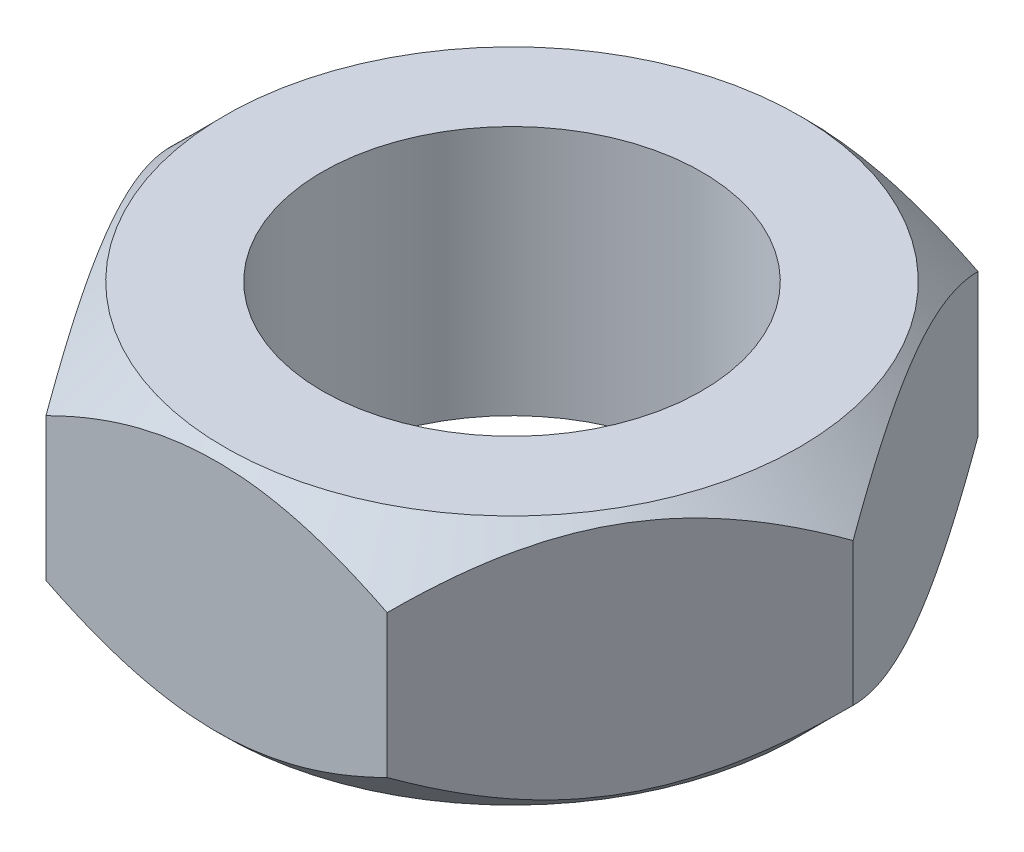
ISO-10303-21;
HEADER;
FILE_DESCRIPTION(('STEP AP214'),'2;1');
FILE_NAME('part.step','',(''),(''),'','','');
FILE_SCHEMA(('AUTOMOTIVE_DESIGN { 1 0 10303 214 1 1 1 1 }'));
ENDSEC;
DATA;
#1=APPLICATION_CONTEXT('core data for automotive mechanical design processes');
#2=APPLICATION_PROTOCOL_DEFINITION('international standard','automotive_design',2000,#1);
#3=PRODUCT_CONTEXT('',#1,'mechanical');
#4=PRODUCT('Part','Part','',(#3));
#5=PRODUCT_RELATED_PRODUCT_CATEGORY('part','',(#4));
#6=PRODUCT_DEFINITION_FORMATION('','',#4);
#7=PRODUCT_DEFINITION_CONTEXT('part definition',#1,'design');
#8=PRODUCT_DEFINITION('design','',#6,#7);
#9=PRODUCT_DEFINITION_SHAPE('','',#8);
#10=(LENGTH_UNIT() NAMED_UNIT(*) SI_UNIT(.MILLI.,.METRE.));
#11=(NAMED_UNIT(*) PLANE_ANGLE_UNIT() SI_UNIT($,.RADIAN.));
#12=(NAMED_UNIT(*) SI_UNIT($,.STERADIAN.) SOLID_ANGLE_UNIT());
#13=UNCERTAINTY_MEASURE_WITH_UNIT(LENGTH_MEASURE(1.E-05),#10,'distance_accuracy_value','');
#14=(GEOMETRIC_REPRESENTATION_CONTEXT(3) GLOBAL_UNCERTAINTY_ASSIGNED_CONTEXT((#13)) GLOBAL_UNIT_ASSIGNED_CONTEXT((#10,
#11,#12)) REPRESENTATION_CONTEXT('',''));
#15=CARTESIAN_POINT('',(0.,0.,0.));
#16=DIRECTION('',(0.,0.,1.));
#17=DIRECTION('',(1.,0.,0.));
#18=AXIS2_PLACEMENT_3D('',#15,#16,#17);
#19=CARTESIAN_POINT('',(-3.14655896708346,-1.155,0.));
#20=DIRECTION('',(-0.866025403784439,0.,0.5));
#21=DIRECTION('',(0.5,0.,0.866025403784439));
#22=AXIS2_PLACEMENT_3D('',#19,#20,#21);
#23=PLANE('',#22);
#24=DIRECTION('',(0.,1.,0.));
#25=VECTOR('',#24,1.);
#26=CARTESIAN_POINT('',(-3.14655896708346,-1.155,0.));
#27=LINE('',#26,#25);
#28=CARTESIAN_POINT('',(-3.14655896705142,-0.658441033018876,-9.91987847607198E-12));
#29=VERTEX_POINT('',#28);
#30=CARTESIAN_POINT('',(-3.14655896705142,0.658441032981914,9.9205367773086E-12));
#31=VERTEX_POINT('',#30);
#32=EDGE_CURVE('E39',#29,#31,#27,.T.);
#33=ORIENTED_EDGE('',*,*,#32,.F.);
#34=CARTESIAN_POINT('',(-1.57327947661864,-0.65844102605013,2.72500001199114));
#35=CARTESIAN_POINT('',(-1.62735386123348,-0.712463516904452,2.63134043045022));
#36=CARTESIAN_POINT('',(-1.6823323706731,-0.763312652071408,2.53611485877639));
#37=CARTESIAN_POINT('',(-1.79443919346344,-0.856415247858666,2.34194014582841));
#38=CARTESIAN_POINT('',(-1.85157816235362,-0.898616923151454,2.24297254861852));
#39=CARTESIAN_POINT('',(-1.96679609041732,-0.970908676922338,2.04340924326938));
#40=CARTESIAN_POINT('',(-2.02484572287343,-1.00118040895592,1.9428643304947));
#41=CARTESIAN_POINT('',(-2.14222259544126,-1.04781977786927,1.73956162357367));
#42=CARTESIAN_POINT('',(-2.20154625243596,-1.06422221622433,1.63681003556805));
#43=CARTESIAN_POINT('',(-2.30379330787486,-1.07902183783569,1.45971294062358));
#44=CARTESIAN_POINT('',(-2.34658470507545,-1.08121199921989,1.3855960665453));
#45=CARTESIAN_POINT('',(-2.43209748584829,-1.07751747483381,1.23748358555024));
#46=CARTESIAN_POINT('',(-2.47481883962627,-1.07162995875759,1.16348803023865));
#47=CARTESIAN_POINT('',(-2.559858086055,-1.05211512241492,1.01619573478671));
#48=CARTESIAN_POINT('',(-2.60217547373816,-1.03847914867073,0.942899869275893));
#49=CARTESIAN_POINT('',(-2.68607845449582,-1.00421588211183,0.797575643697147));
#50=CARTESIAN_POINT('',(-2.72766410343584,-0.983589125474777,0.72554718686731));
#51=CARTESIAN_POINT('',(-2.83415795547277,-0.922368945219737,0.541094424445632));
#52=CARTESIAN_POINT('',(-2.89840651297627,-0.877165914139737,0.429812658536556));
#53=CARTESIAN_POINT('',(-2.99287907813309,-0.800859203653019,0.266181375763585));
#54=CARTESIAN_POINT('',(-3.02401210646256,-0.774048879221555,0.212257388903462));
#55=CARTESIAN_POINT('',(-3.08570170402884,-0.717984625210718,0.105407871620191));
#56=CARTESIAN_POINT('',(-3.11625861267117,-0.688732193218045,0.0524817533294258));
#57=CARTESIAN_POINT('',(-3.14655896709454,-0.658441032962138,-1.91937883932893E-11));
#58=B_SPLINE_CURVE_WITH_KNOTS('',3,(#34,#35,#36,#37,#38,#39,#40,#41,#42,#43,#44,#45,#46,#47,#48,
#49,#50,#51,#52,#53,#54,#55,#56,#57),.UNSPECIFIED.,.F.,.F.,(4,2,2,2,2,2,2,2,2,2,2,4),(0.,
0.362923532673089,0.727960707050709,1.0872023253452,1.44553982005292,1.70200875168351,
1.95856756941672,2.21541347676497,2.47223968905425,2.88003270467439,3.08337607099432,
3.28659564327083),.UNSPECIFIED.);
#59=CARTESIAN_POINT('',(-1.57327944834864,-0.658441050569766,2.725));
#60=VERTEX_POINT('',#59);
#61=EDGE_CURVE('E68',#60,#29,#58,.T.);
#62=ORIENTED_EDGE('',*,*,#61,.F.);
#63=DIRECTION('',(0.,1.,0.));
#64=VECTOR('',#63,1.);
#65=CARTESIAN_POINT('',(-1.57327948354173,-1.155,2.725));
#66=LINE('',#65,#64);
#67=CARTESIAN_POINT('',(-1.57327950113764,0.65844105056913,2.72499996952299));
#68=VERTEX_POINT('',#67);
#69=EDGE_CURVE('E95',#68,#60,#66,.F.);
#70=ORIENTED_EDGE('',*,*,#69,.F.);
#71=CARTESIAN_POINT('',(-3.14655896708598,0.658441032957749,-2.26789969055328E-11));
#72=CARTESIAN_POINT('',(-3.09248458291758,0.712463523021247,0.0936595807567098));
#73=CARTESIAN_POINT('',(-3.03750607393318,0.763312657411236,0.188885151646903));
#74=CARTESIAN_POINT('',(-2.92539925209313,0.856415251722121,0.383059862952489));
#75=CARTESIAN_POINT('',(-2.86826028369845,0.898616926317329,0.48202745930283));
#76=CARTESIAN_POINT('',(-2.75304235658878,0.970908678902312,0.681590762998606));
#77=CARTESIAN_POINT('',(-2.69499272458834,1.00118041043142,0.782135674984402));
#78=CARTESIAN_POINT('',(-2.57761585296116,1.04781977853535,0.985438380276408));
#79=CARTESIAN_POINT('',(-2.51829219645127,1.0642222165841,1.0881899674422));
#80=CARTESIAN_POINT('',(-2.41604514151374,1.07902183793696,1.26528706151824));
#81=CARTESIAN_POINT('',(-2.37325374432372,1.08121199924301,1.33940393557823));
#82=CARTESIAN_POINT('',(-2.28774096357569,1.07751747470588,1.48751641653034));
#83=CARTESIAN_POINT('',(-2.24501960981194,1.07162995855678,1.56151197181726));
#84=CARTESIAN_POINT('',(-2.15998036343472,1.05211512208262,1.70880426717998));
#85=CARTESIAN_POINT('',(-2.11766297578862,1.03847914828348,1.78210013262661));
#86=CARTESIAN_POINT('',(-2.03375999510579,1.00421588163247,1.92742435807575));
#87=CARTESIAN_POINT('',(-1.99217434620352,0.983589124958324,1.99945281484019));
#88=CARTESIAN_POINT('',(-1.8856805006944,0.922368948325799,2.18390556595539));
#89=CARTESIAN_POINT('',(-1.82143194946698,0.877165922422192,2.29518732099396));
#90=CARTESIAN_POINT('',(-1.72695939334917,0.800859221130555,2.45881858811091));
#91=CARTESIAN_POINT('',(-1.69582636796464,0.774048899995241,2.51274256987025));
#92=CARTESIAN_POINT('',(-1.6341367761759,0.717984652945768,2.61959207714653));
#93=CARTESIAN_POINT('',(-1.60357987036637,0.68873222461744,2.67251819053073));
#94=CARTESIAN_POINT('',(-1.57327951873355,0.658441068165039,2.72499993904598));
#95=B_SPLINE_CURVE_WITH_KNOTS('',3,(#71,#72,#73,#74,#75,#76,#77,#78,#79,#80,#81,#82,#83,#84,#85,
#86,#87,#88,#89,#90,#91,#92,#93,#94),.UNSPECIFIED.,.F.,.F.,(4,2,2,2,2,2,2,2,2,2,2,4),(0.,
0.362923529235543,0.727960700102343,1.08720231538261,1.44553980710645,1.70200873866747,
1.95856755633097,2.2154134634879,2.47223967558245,2.88003265077597,3.08337599696134,
3.28659554916829),.UNSPECIFIED.);
#96=EDGE_CURVE('E69',#31,#68,#95,.T.);
#97=ORIENTED_EDGE('',*,*,#96,.F.);
#98=EDGE_LOOP('',(#33,#62,#70,#97));
#99=FACE_BOUND('',#98,.T.);
#100=ADVANCED_FACE('F15',(#99),#23,.T.);
#101=CARTESIAN_POINT('',(-1.57327948354173,-1.155,2.725));
#102=DIRECTION('',(0.,0.,1.));
#103=DIRECTION('',(1.,0.,0.));
#104=AXIS2_PLACEMENT_3D('',#101,#102,#103);
#105=PLANE('',#104);
#106=ORIENTED_EDGE('',*,*,#69,.T.);
#107=CARTESIAN_POINT('',(1.57327949738658,-0.658441026050797,2.725));
#108=CARTESIAN_POINT('',(1.46513072821672,-0.712463516875228,2.725));
#109=CARTESIAN_POINT('',(1.35517370939962,-0.763312652015631,2.725));
#110=CARTESIAN_POINT('',(1.13096006394724,-0.856415247761064,2.725));
#111=CARTESIAN_POINT('',(1.01668212623304,-0.898616923038605,2.725));
#112=CARTESIAN_POINT('',(0.786246270113395,-0.970908676834788,2.725));
#113=CARTESIAN_POINT('',(0.670147005138711,-1.00118040889625,2.725));
#114=CARTESIAN_POINT('',(0.435393259874703,-1.04781977785093,2.725));
#115=CARTESIAN_POINT('',(0.316745945819439,-1.06422221621953,2.725));
#116=CARTESIAN_POINT('',(0.112251834851884,-1.07902183783741,2.725));
#117=CARTESIAN_POINT('',(0.0266690404272164,-1.0812119992211,2.725));
#118=CARTESIAN_POINT('',(-0.144356521165615,-1.07751747482955,2.725));
#119=CARTESIAN_POINT('',(-0.229799228745238,-1.07162995874835,2.725));
#120=CARTESIAN_POINT('',(-0.399877721602359,-1.05211512239714,2.725));
#121=CARTESIAN_POINT('',(-0.484512496945161,-1.03847914865362,2.725));
#122=CARTESIAN_POINT('',(-0.652318458414021,-1.00421588210003,2.725));
#123=CARTESIAN_POINT('',(-0.73548975627113,-0.983589125467719,2.725));
#124=CARTESIAN_POINT('',(-0.948477447671822,-0.922368948855335,2.725));
#125=CARTESIAN_POINT('',(-1.07697455044826,-0.877165922891068,2.725));
#126=CARTESIAN_POINT('',(-1.26591966315461,-0.800859221458968,2.725));
#127=CARTESIAN_POINT('',(-1.32818571408183,-0.774048900266952,2.725));
#128=CARTESIAN_POINT('',(-1.4515648979694,-0.717984653091195,2.725));
#129=CARTESIAN_POINT('',(-1.51267870974041,-0.688732224693312,2.725));
#130=CARTESIAN_POINT('',(-1.57327941315554,-0.658441068166313,2.725));
#131=B_SPLINE_CURVE_WITH_KNOTS('',3,(#107,#108,#109,#110,#111,#112,#113,#114,#115,#116,#117,
#118,#119,#120,#121,#122,#123,#124,#125,#126,#127,#128,#129,#130),.UNSPECIFIED.,.F.,.F.,(4,2,2,
2,2,2,2,2,2,2,2,4),(0.,0.362923532471594,0.727960706648163,1.08720232514412,1.44553982005144,
1.70200875175219,1.95856756955672,2.21541347683605,2.4722396890527,2.8800326652089,
3.08337601189709,3.28659556460498),.UNSPECIFIED.);
#132=CARTESIAN_POINT('',(1.57327950113794,-0.658441050569433,2.72499996952246));
#133=VERTEX_POINT('',#132);
#134=EDGE_CURVE('E81',#133,#60,#131,.T.);
#135=ORIENTED_EDGE('',*,*,#134,.F.);
#136=DIRECTION('',(0.,1.,0.));
#137=VECTOR('',#136,1.);
#138=CARTESIAN_POINT('',(1.57327948354173,-1.155,2.725));
#139=LINE('',#138,#137);
#140=CARTESIAN_POINT('',(1.57327944835712,0.658441050565525,2.725));
#141=VERTEX_POINT('',#140);
#142=EDGE_CURVE('E93',#141,#133,#139,.F.);
#143=ORIENTED_EDGE('',*,*,#142,.F.);
#144=CARTESIAN_POINT('',(-1.57327949738536,0.658441026051404,2.725));
#145=CARTESIAN_POINT('',(-1.46513072821556,0.712463516875775,2.725));
#146=CARTESIAN_POINT('',(-1.35517370939852,0.763312652016118,2.725));
#147=CARTESIAN_POINT('',(-1.13096006394627,0.856415247761435,2.725));
#148=CARTESIAN_POINT('',(-1.01668212623213,0.89861692303892,2.725));
#149=CARTESIAN_POINT('',(-0.786246270112653,0.970908676834991,2.725));
#150=CARTESIAN_POINT('',(-0.670147005138069,1.0011804088964,2.725));
#151=CARTESIAN_POINT('',(-0.435393259874268,1.047819777851,2.725));
#152=CARTESIAN_POINT('',(-0.316745945819111,1.06422221621956,2.725));
#153=CARTESIAN_POINT('',(-0.112251834851674,1.07902183783741,2.725));
#154=CARTESIAN_POINT('',(-0.0266690404270152,1.0812119992211,2.725));
#155=CARTESIAN_POINT('',(0.144356521165797,1.07751747482954,2.725));
#156=CARTESIAN_POINT('',(0.229799228745409,1.07162995874834,2.725));
#157=CARTESIAN_POINT('',(0.399877721602521,1.05211512239712,2.725));
#158=CARTESIAN_POINT('',(0.484512496945325,1.03847914865359,2.725));
#159=CARTESIAN_POINT('',(0.652318458414186,1.00421588209999,2.725));
#160=CARTESIAN_POINT('',(0.735489756271297,0.983589125467675,2.725));
#161=CARTESIAN_POINT('',(0.948477447675009,0.922368948854412,2.725));
#162=CARTESIAN_POINT('',(1.07697455045436,0.877165922888918,2.725));
#163=CARTESIAN_POINT('',(1.26591966316491,0.800859221454648,2.725));
#164=CARTESIAN_POINT('',(1.3281857140935,0.774048900261857,2.725));
#165=CARTESIAN_POINT('',(1.45156489798376,0.717984653084463,2.725));
#166=CARTESIAN_POINT('',(1.51267870975608,0.688732224685721,2.725));
#167=CARTESIAN_POINT('',(1.57327941317251,0.65844106815783,2.725));
#168=B_SPLINE_CURVE_WITH_KNOTS('',3,(#144,#145,#146,#147,#148,#149,#150,#151,#152,#153,#154,
#155,#156,#157,#158,#159,#160,#161,#162,#163,#164,#165,#166,#167),.UNSPECIFIED.,.F.,.F.,(4,2,2,
2,2,2,2,2,2,2,2,4),(0.,0.362923532471359,0.727960706647685,1.08720232514331,1.44553982005031,
1.70200875175102,1.95856756955553,2.21541347683486,2.47223968905152,2.88003266521715,
3.08337601191002,3.28659556462258),.UNSPECIFIED.);
#169=EDGE_CURVE('E165',#68,#141,#168,.T.);
#170=ORIENTED_EDGE('',*,*,#169,.F.);
#171=EDGE_LOOP('',(#106,#135,#143,#170));
#172=FACE_BOUND('',#171,.T.);
#173=ADVANCED_FACE('F153',(#172),#105,.T.);
#174=CARTESIAN_POINT('',(1.57327948354173,-1.155,2.725));
#175=DIRECTION('',(0.866025403784439,0.,0.5));
#176=DIRECTION('',(0.5,0.,-0.866025403784439));
#177=AXIS2_PLACEMENT_3D('',#174,#175,#176);
#178=PLANE('',#177);
#179=ORIENTED_EDGE('',*,*,#142,.T.);
#180=CARTESIAN_POINT('',(3.14655896709377,-0.658441032955759,-2.79707116706525E-11));
#181=CARTESIAN_POINT('',(3.09248458292254,-0.712463523018576,0.093659580751081));
#182=CARTESIAN_POINT('',(3.03750607393678,-0.763312657408559,0.188885151641451));
#183=CARTESIAN_POINT('',(2.92539925209531,-0.856415251719988,0.383059862947903));
#184=CARTESIAN_POINT('',(2.86826028370058,-0.898616926315747,0.482027459298937));
#185=CARTESIAN_POINT('',(2.75304235659039,-0.970908678901546,0.681590762996027));
#186=CARTESIAN_POINT('',(2.6949927245895,-1.00118041043092,0.782135674982447));
#187=CARTESIAN_POINT('',(2.5776158529615,-1.04781977853525,0.985438380275756));
#188=CARTESIAN_POINT('',(2.51829219645125,-1.06422221658414,1.08818996744222));
#189=CARTESIAN_POINT('',(2.4160451415133,-1.079021837937,1.26528706151902));
#190=CARTESIAN_POINT('',(2.37325374432323,-1.08121199924303,1.33940393557908));
#191=CARTESIAN_POINT('',(2.28774096357511,-1.07751747470583,1.48751641653133));
#192=CARTESIAN_POINT('',(2.24501960981132,-1.07162995855668,1.56151197181833));
#193=CARTESIAN_POINT('',(2.15998036343402,-1.05211512208242,1.70880426718118));
#194=CARTESIAN_POINT('',(2.1176629757879,-1.03847914828323,1.78210013262786));
#195=CARTESIAN_POINT('',(2.033759995105,-1.0042158816321,1.92742435807711));
#196=CARTESIAN_POINT('',(1.9921743462027,-0.983589124957898,1.99945281484161));
#197=CARTESIAN_POINT('',(1.88568050069381,-0.922368948325392,2.1839055659564));
#198=CARTESIAN_POINT('',(1.82143194946666,-0.877165922421934,2.29518732099452));
#199=CARTESIAN_POINT('',(1.72695939334921,-0.800859221130585,2.45881858811084));
#200=CARTESIAN_POINT('',(1.6958263679648,-0.774048899995375,2.51274256986998));
#201=CARTESIAN_POINT('',(1.63413677617628,-0.717984652946126,2.61959207714586));
#202=CARTESIAN_POINT('',(1.60357987036687,-0.688732224617919,2.67251819052987));
#203=CARTESIAN_POINT('',(1.57327951873416,-0.658441068165646,2.72499993904493));
#204=B_SPLINE_CURVE_WITH_KNOTS('',3,(#180,#181,#182,#183,#184,#185,#186,#187,#188,#189,#190,
#191,#192,#193,#194,#195,#196,#197,#198,#199,#200,#201,#202,#203),.UNSPECIFIED.,.F.,.F.,(4,2,2,
2,2,2,2,2,2,2,2,4),(0.,0.362923529237788,0.727960700106964,1.08720231538962,1.4455398071158,
1.70200873867707,1.95856755634082,2.21541346349797,2.47223967559275,2.88003265078467,
3.08337599696928,3.28659554917546),.UNSPECIFIED.);
#205=CARTESIAN_POINT('',(3.14655896706963,-0.658441032986452,0.));
#206=VERTEX_POINT('',#205);
#207=EDGE_CURVE('E142',#206,#133,#204,.T.);
#208=ORIENTED_EDGE('',*,*,#207,.F.);
#209=DIRECTION('',(0.,1.,0.));
#210=VECTOR('',#209,1.);
#211=CARTESIAN_POINT('',(3.14655896708346,-1.155,0.));
#212=LINE('',#211,#210);
#213=CARTESIAN_POINT('',(3.1465589671878,0.658441032736116,0.));
#214=VERTEX_POINT('',#213);
#215=EDGE_CURVE('E91',#214,#206,#212,.F.);
#216=ORIENTED_EDGE('',*,*,#215,.F.);
#217=CARTESIAN_POINT('',(1.57327947662712,0.658441026058613,2.72500001197645));
#218=CARTESIAN_POINT('',(1.62735386124146,0.712463516912001,2.6313404304364));
#219=CARTESIAN_POINT('',(1.68233237068057,0.763312652078038,2.53611485876345));
#220=CARTESIAN_POINT('',(1.79443919346983,0.856415247863539,2.34194014581734));
#221=CARTESIAN_POINT('',(1.85157816235944,0.898616923155491,2.24297254860843));
#222=CARTESIAN_POINT('',(1.96679609042198,0.970908676924886,2.04340924326131));
#223=CARTESIAN_POINT('',(2.02484572287748,1.00118040895782,1.94286433048767));
#224=CARTESIAN_POINT('',(2.14222259544408,1.04781977787011,1.73956162356879));
#225=CARTESIAN_POINT('',(2.20154625243814,1.06422221622478,1.63681003556428));
#226=CARTESIAN_POINT('',(2.30379330787636,1.07902183783581,1.45971294062098));
#227=CARTESIAN_POINT('',(2.34658470507692,1.08121199921992,1.38559606654274));
#228=CARTESIAN_POINT('',(2.4320974858497,1.07751747483365,1.23748358554779));
#229=CARTESIAN_POINT('',(2.47481883962765,1.07162995875736,1.16348803023626));
#230=CARTESIAN_POINT('',(2.55985808605632,1.05211512241454,1.01619573478443));
#231=CARTESIAN_POINT('',(2.60217547373945,1.03847914867028,0.942899869273661));
#232=CARTESIAN_POINT('',(2.68607845449705,1.00421588211126,0.79757564369502));
#233=CARTESIAN_POINT('',(2.72766410343704,0.98358912547415,0.725547186865236));
#234=CARTESIAN_POINT('',(2.83415795547444,0.922368945218677,0.541094424442732));
#235=CARTESIAN_POINT('',(2.89840651297843,0.877165914138177,0.42981265853281));
#236=CARTESIAN_POINT('',(2.99287907813595,0.800859203650614,0.266181375758628));
#237=CARTESIAN_POINT('',(3.02401210646565,0.774048879218855,0.212257388898115));
#238=CARTESIAN_POINT('',(3.08570170403237,0.717984625207406,0.105407871614081));
#239=CARTESIAN_POINT('',(3.11625861267492,0.688732193214415,0.0524817533229416));
#240=CARTESIAN_POINT('',(3.1465589670985,0.658441032958181,-2.60468463529722E-11));
#241=B_SPLINE_CURVE_WITH_KNOTS('',3,(#217,#218,#219,#220,#221,#222,#223,#224,#225,#226,#227,
#228,#229,#230,#231,#232,#233,#234,#235,#236,#237,#238,#239,#240),.UNSPECIFIED.,.F.,.F.,(4,2,2,
2,2,2,2,2,2,2,2,4),(0.,0.36292353266914,0.727960707042721,1.08720232533324,1.44553982003704,
1.70200875166745,1.95856756940048,2.21541347674859,2.47223968903772,2.88003270466112,
3.08337607098263,3.28659564326072),.UNSPECIFIED.);
#242=EDGE_CURVE('E158',#141,#214,#241,.T.);
#243=ORIENTED_EDGE('',*,*,#242,.F.);
#244=EDGE_LOOP('',(#179,#208,#216,#243));
#245=FACE_BOUND('',#244,.T.);
#246=ADVANCED_FACE('F150',(#245),#178,.T.);
#247=CARTESIAN_POINT('',(3.14655896708346,-1.155,0.));
#248=DIRECTION('',(0.866025403784439,0.,-0.5));
#249=DIRECTION('',(-0.5,0.,-0.866025403784439));
#250=AXIS2_PLACEMENT_3D('',#247,#248,#249);
#251=PLANE('',#250);
#252=ORIENTED_EDGE('',*,*,#215,.T.);
#253=CARTESIAN_POINT('',(1.57327947662007,-0.658441026051557,-2.72500001198867));
#254=CARTESIAN_POINT('',(1.62735386123482,-0.712463516905724,-2.63134043044789));
#255=CARTESIAN_POINT('',(1.68233237067437,-0.763312652072528,-2.5361148587742));
#256=CARTESIAN_POINT('',(1.79443919346453,-0.856415247859495,-2.34194014582652));
#257=CARTESIAN_POINT('',(1.85157816235461,-0.898616923152143,-2.2429725486168));
#258=CARTESIAN_POINT('',(1.96679609041811,-0.970908676922775,-2.04340924326799));
#259=CARTESIAN_POINT('',(2.02484572287412,-1.00118040895625,-1.94286433049349));
#260=CARTESIAN_POINT('',(2.14222259544174,-1.04781977786941,-1.73956162357284));
#261=CARTESIAN_POINT('',(2.20154625243633,-1.06422221622441,-1.63681003556741));
#262=CARTESIAN_POINT('',(2.30379330787511,-1.07902183783571,-1.45971294062314));
#263=CARTESIAN_POINT('',(2.34658470507569,-1.0812119992199,-1.38559606654487));
#264=CARTESIAN_POINT('',(2.43209748584852,-1.07751747483378,-1.23748358554983));
#265=CARTESIAN_POINT('',(2.4748188396265,-1.07162995875755,-1.16348803023826));
#266=CARTESIAN_POINT('',(2.55985808605522,-1.05211512241486,-1.01619573478634));
#267=CARTESIAN_POINT('',(2.60217547373837,-1.03847914867065,-0.942899869275523));
#268=CARTESIAN_POINT('',(2.68607845449603,-1.00421588211173,-0.797575643696791));
#269=CARTESIAN_POINT('',(2.72766410343605,-0.983589125474671,-0.725547186866961));
#270=CARTESIAN_POINT('',(2.83415795547364,-0.922368945219218,-0.541094424444118));
#271=CARTESIAN_POINT('',(2.8984065129778,-0.877165914138655,-0.429812658533911));
#272=CARTESIAN_POINT('',(2.99287907813556,-0.800859203650949,-0.266181375759311));
#273=CARTESIAN_POINT('',(3.02401210646533,-0.774048879219132,-0.212257388898658));
#274=CARTESIAN_POINT('',(3.08570170403221,-0.717984625207554,-0.105407871614348));
#275=CARTESIAN_POINT('',(3.11625861267484,-0.688732193214492,-0.0524817533230742));
#276=CARTESIAN_POINT('',(3.1465589670985,-0.658441032958181,2.60464857451398E-11));
#277=B_SPLINE_CURVE_WITH_KNOTS('',3,(#253,#254,#255,#256,#257,#258,#259,#260,#261,#262,#263,
#264,#265,#266,#267,#268,#269,#270,#271,#272,#273,#274,#275,#276),.UNSPECIFIED.,.F.,.F.,(4,2,2,
2,2,2,2,2,2,2,2,4),(0.,0.362923532672444,0.727960707049404,1.08720232534321,1.44553982005026,
1.7020087516808,1.95856756941398,2.21541347676221,2.47223968905147,2.88003270467585,
3.08337607099788,3.28659564327648),.UNSPECIFIED.);
#278=CARTESIAN_POINT('',(1.57327944835006,-0.658441050569053,-2.725));
#279=VERTEX_POINT('',#278);
#280=EDGE_CURVE('E87',#279,#206,#277,.T.);
#281=ORIENTED_EDGE('',*,*,#280,.F.);
#282=DIRECTION('',(0.,1.,0.));
#283=VECTOR('',#282,1.);
#284=CARTESIAN_POINT('',(1.57327948354173,-1.155,-2.725));
#285=LINE('',#284,#283);
#286=CARTESIAN_POINT('',(1.5732795011339,0.658441050565388,-2.72499996952947));
#287=VERTEX_POINT('',#286);
#288=EDGE_CURVE('E71',#287,#279,#285,.F.);
#289=ORIENTED_EDGE('',*,*,#288,.F.);
#290=CARTESIAN_POINT('',(3.14655896709377,0.658441032955759,2.79702926037561E-11));
#291=CARTESIAN_POINT('',(3.09248458292253,0.712463523018582,-0.0936595807510935));
#292=CARTESIAN_POINT('',(3.03750607393677,0.763312657408571,-0.188885151641476));
#293=CARTESIAN_POINT('',(2.92539925209529,0.85641525172001,-0.383059862947954));
#294=CARTESIAN_POINT('',(2.86826028370054,0.898616926315773,-0.482027459299));
#295=CARTESIAN_POINT('',(2.75304235659036,0.970908678901566,-0.681590762996092));
#296=CARTESIAN_POINT('',(2.69499272458947,1.00118041043094,-0.7821356749825));
#297=CARTESIAN_POINT('',(2.57761585296149,1.04781977853526,-0.985438380275783));
#298=CARTESIAN_POINT('',(2.51829219645124,1.06422221658414,-1.08818996744224));
#299=CARTESIAN_POINT('',(2.4160451415133,1.079021837937,-1.26528706151901));
#300=CARTESIAN_POINT('',(2.37325374432324,1.08121199924302,-1.33940393557907));
#301=CARTESIAN_POINT('',(2.28774096357512,1.07751747470583,-1.48751641653132));
#302=CARTESIAN_POINT('',(2.24501960981134,1.07162995855668,-1.56151197181831));
#303=CARTESIAN_POINT('',(2.15998036343404,1.05211512208242,-1.70880426718116));
#304=CARTESIAN_POINT('',(2.11766297578791,1.03847914828323,-1.78210013262785));
#305=CARTESIAN_POINT('',(2.033759995105,1.0042158816321,-1.92742435807711));
#306=CARTESIAN_POINT('',(1.9921743462027,0.983589124957899,-1.99945281484161));
#307=CARTESIAN_POINT('',(1.88568050069236,0.922368948324557,-2.18390556595892));
#308=CARTESIAN_POINT('',(1.8214319494638,0.877165922419923,-2.29518732099947));
#309=CARTESIAN_POINT('',(1.72695939334433,0.800859221126493,-2.4588185881193));
#310=CARTESIAN_POINT('',(1.69582636795926,0.774048899990538,-2.51274256987958));
#311=CARTESIAN_POINT('',(1.63413677616945,0.717984652939718,-2.6195920771577));
#312=CARTESIAN_POINT('',(1.6035798703594,0.688732224610685,-2.6725181905428));
#313=CARTESIAN_POINT('',(1.57327951872607,0.658441068157555,-2.72499993905894));
#314=B_SPLINE_CURVE_WITH_KNOTS('',3,(#290,#291,#292,#293,#294,#295,#296,#297,#298,#299,#300,
#301,#302,#303,#304,#305,#306,#307,#308,#309,#310,#311,#312,#313),.UNSPECIFIED.,.F.,.F.,(4,2,2,
2,2,2,2,2,2,2,2,4),(0.,0.362923529237835,0.727960700107057,1.08720231538967,1.4455398071158,
1.70200873867705,1.95856755634079,2.21541346349796,2.47223967559275,2.88003265079374,
3.08337599698286,3.28659554919354),.UNSPECIFIED.);
#315=EDGE_CURVE('E164',#214,#287,#314,.T.);
#316=ORIENTED_EDGE('',*,*,#315,.F.);
#317=EDGE_LOOP('',(#252,#281,#289,#316));
#318=FACE_BOUND('',#317,.T.);
#319=ADVANCED_FACE('F128',(#318),#251,.T.);
#320=CARTESIAN_POINT('',(1.57327948354173,-1.155,-2.725));
#321=DIRECTION('',(0.,0.,-1.));
#322=DIRECTION('',(-1.,0.,0.));
#323=AXIS2_PLACEMENT_3D('',#320,#321,#322);
#324=PLANE('',#323);
#325=ORIENTED_EDGE('',*,*,#288,.T.);
#326=CARTESIAN_POINT('',(-1.573279497388,-0.658441026050085,-2.725));
#327=CARTESIAN_POINT('',(-1.46513072821805,-0.712463516874596,-2.725));
#328=CARTESIAN_POINT('',(-1.35517370940087,-0.763312652015077,-2.725));
#329=CARTESIAN_POINT('',(-1.13096006394831,-0.856415247760659,-2.725));
#330=CARTESIAN_POINT('',(-1.016682126234,-0.898616923038271,-2.725));
#331=CARTESIAN_POINT('',(-0.786246270114162,-0.970908676834579,-2.725));
#332=CARTESIAN_POINT('',(-0.670147005139379,-1.0011804088961,-2.725));
#333=CARTESIAN_POINT('',(-0.435393259875169,-1.04781977785086,-2.725));
#334=CARTESIAN_POINT('',(-0.316745945819801,-1.06422221621949,-2.725));
#335=CARTESIAN_POINT('',(-0.112251834852137,-1.0790218378374,-2.725));
#336=CARTESIAN_POINT('',(-0.0266690404274655,-1.0812119992211,-2.725));
#337=CARTESIAN_POINT('',(0.144356521165375,-1.07751747482957,-2.725));
#338=CARTESIAN_POINT('',(0.229799228745001,-1.07162995874837,-2.725));
#339=CARTESIAN_POINT('',(0.399877721602132,-1.05211512239718,-2.725));
#340=CARTESIAN_POINT('',(0.484512496944941,-1.03847914865366,-2.725));
#341=CARTESIAN_POINT('',(0.652318458413813,-1.00421588210008,-2.725));
#342=CARTESIAN_POINT('',(0.735489756270929,-0.983589125467772,-2.725));
#343=CARTESIAN_POINT('',(0.948477447672174,-0.922368948855242,-2.725));
#344=CARTESIAN_POINT('',(1.07697455044914,-0.877165922890761,-2.725));
#345=CARTESIAN_POINT('',(1.26591966315625,-0.80085922145828,-2.725));
#346=CARTESIAN_POINT('',(1.32818571408372,-0.774048900266127,-2.725));
#347=CARTESIAN_POINT('',(1.45156489797178,-0.71798465309008,-2.725));
#348=CARTESIAN_POINT('',(1.51267870974303,-0.688732224692044,-2.725));
#349=CARTESIAN_POINT('',(1.5732794131584,-0.658441068164886,-2.725));
#350=B_SPLINE_CURVE_WITH_KNOTS('',3,(#326,#327,#328,#329,#330,#331,#332,#333,#334,#335,#336,
#337,#338,#339,#340,#341,#342,#343,#344,#345,#346,#347,#348,#349),.UNSPECIFIED.,.F.,.F.,(4,2,2,
2,2,2,2,2,2,2,2,4),(0.,0.362923532471936,0.727960706648854,1.08720232514513,1.44553982005278,
1.70200875175353,1.95856756955808,2.21541347683742,2.47223968905409,2.88003266521199,
3.08337601190102,3.28659556460976),.UNSPECIFIED.);
#351=CARTESIAN_POINT('',(-1.5732795011383,-0.658441050569789,-2.72499996952185));
#352=VERTEX_POINT('',#351);
#353=EDGE_CURVE('E86',#352,#279,#350,.T.);
#354=ORIENTED_EDGE('',*,*,#353,.F.);
#355=DIRECTION('',(0.,1.,0.));
#356=VECTOR('',#355,1.);
#357=CARTESIAN_POINT('',(-1.57327948354173,-1.155,-2.725));
#358=LINE('',#357,#356);
#359=CARTESIAN_POINT('',(-1.57327944834699,0.658441050570591,-2.725));
#360=VERTEX_POINT('',#359);
#361=EDGE_CURVE('E70',#360,#352,#358,.F.);
#362=ORIENTED_EDGE('',*,*,#361,.F.);
#363=CARTESIAN_POINT('',(1.57327949737039,0.658441026058887,-2.725));
#364=CARTESIAN_POINT('',(1.4651307282015,0.712463516882423,-2.725));
#365=CARTESIAN_POINT('',(1.35517370938539,0.763312652021946,-2.725));
#366=CARTESIAN_POINT('',(1.13096006393509,0.856415247765697,-2.725));
#367=CARTESIAN_POINT('',(1.01668212622198,0.898616923042438,-2.725));
#368=CARTESIAN_POINT('',(0.786246270104556,0.970908676837205,-2.725));
#369=CARTESIAN_POINT('',(0.670147005131008,1.00118040889805,-2.725));
#370=CARTESIAN_POINT('',(0.435393259869345,1.04781977785173,-2.725));
#371=CARTESIAN_POINT('',(0.316745945815289,1.06422221621996,-2.725));
#372=CARTESIAN_POINT('',(0.112251834849009,1.07902183783752,-2.725));
#373=CARTESIAN_POINT('',(0.0266690404243917,1.08121199922113,-2.725));
#374=CARTESIAN_POINT('',(-0.14435652116833,1.07751747482941,-2.725));
#375=CARTESIAN_POINT('',(-0.229799228747892,1.07162995874813,-2.725));
#376=CARTESIAN_POINT('',(-0.399877721604893,1.05211512239677,-2.725));
#377=CARTESIAN_POINT('',(-0.484512496947635,1.03847914865318,-2.725));
#378=CARTESIAN_POINT('',(-0.652318458416371,1.00421588209948,-2.725));
#379=CARTESIAN_POINT('',(-0.735489756273418,0.98358912546712,-2.725));
#380=CARTESIAN_POINT('',(-0.948477447673067,0.922368948854884,-2.725));
#381=CARTESIAN_POINT('',(-1.07697455044855,0.877165922890928,-2.725));
#382=CARTESIAN_POINT('',(-1.26591966315352,0.800859221459418,-2.725));
#383=CARTESIAN_POINT('',(-1.32818571408028,0.77404890026762,-2.725));
#384=CARTESIAN_POINT('',(-1.45156489796697,0.717984653092332,-2.725));
#385=CARTESIAN_POINT('',(-1.51267870973754,0.6887322246947,-2.725));
#386=CARTESIAN_POINT('',(-1.57327941315224,0.658441068167963,-2.725));
#387=B_SPLINE_CURVE_WITH_KNOTS('',3,(#363,#364,#365,#366,#367,#368,#369,#370,#371,#372,#373,
#374,#375,#376,#377,#378,#379,#380,#381,#382,#383,#384,#385,#386),.UNSPECIFIED.,.F.,.F.,(4,2,2,
2,2,2,2,2,2,2,2,4),(0.,0.362923532467797,0.727960706640483,1.08720232513268,1.4455398200363,
1.70200875173688,1.95856756954125,2.21541347682043,2.47223968903694,2.88003266519016,
3.08337601187683,3.28659556458322),.UNSPECIFIED.);
#388=EDGE_CURVE('E111',#287,#360,#387,.T.);
#389=ORIENTED_EDGE('',*,*,#388,.F.);
#390=EDGE_LOOP('',(#325,#354,#362,#389));
#391=FACE_BOUND('',#390,.T.);
#392=ADVANCED_FACE('F122',(#391),#324,.T.);
#393=CARTESIAN_POINT('',(-1.57327948354173,-1.155,-2.725));
#394=DIRECTION('',(-0.866025403784439,0.,-0.5));
#395=DIRECTION('',(-0.5,0.,0.866025403784439));
#396=AXIS2_PLACEMENT_3D('',#393,#394,#395);
#397=PLANE('',#396);
#398=ORIENTED_EDGE('',*,*,#361,.T.);
#399=CARTESIAN_POINT('',(-3.14655896708598,-0.658441032957749,2.26797170880035E-11));
#400=CARTESIAN_POINT('',(-3.09248458291758,-0.712463523021246,-0.0936595807567072));
#401=CARTESIAN_POINT('',(-3.03750607393318,-0.763312657411234,-0.188885151646898));
#402=CARTESIAN_POINT('',(-2.92539925209313,-0.856415251722117,-0.383059862952481));
#403=CARTESIAN_POINT('',(-2.86826028369846,-0.898616926317324,-0.48202745930282));
#404=CARTESIAN_POINT('',(-2.75304235658879,-0.970908678902309,-0.681590762998595));
#405=CARTESIAN_POINT('',(-2.69499272458834,-1.00118041043142,-0.782135674984393));
#406=CARTESIAN_POINT('',(-2.57761585296116,-1.04781977853535,-0.985438380276403));
#407=CARTESIAN_POINT('',(-2.51829219645127,-1.0642222165841,-1.0881899674422));
#408=CARTESIAN_POINT('',(-2.41604514151374,-1.07902183793696,-1.26528706151824));
#409=CARTESIAN_POINT('',(-2.37325374432372,-1.08121199924301,-1.33940393557823));
#410=CARTESIAN_POINT('',(-2.28774096357568,-1.07751747470588,-1.48751641653034));
#411=CARTESIAN_POINT('',(-2.24501960981194,-1.07162995855678,-1.56151197181727));
#412=CARTESIAN_POINT('',(-2.15998036343472,-1.05211512208262,-1.70880426717998));
#413=CARTESIAN_POINT('',(-2.11766297578862,-1.03847914828348,-1.78210013262661));
#414=CARTESIAN_POINT('',(-2.03375999510579,-1.00421588163247,-1.92742435807575));
#415=CARTESIAN_POINT('',(-1.99217434620352,-0.983589124958324,-1.99945281484019));
#416=CARTESIAN_POINT('',(-1.88568050069463,-0.922368948325936,-2.18390556595498));
#417=CARTESIAN_POINT('',(-1.82143194946745,-0.877165922422519,-2.29518732099315));
#418=CARTESIAN_POINT('',(-1.72695939334997,-0.800859221131223,-2.45881858810953));
#419=CARTESIAN_POINT('',(-1.69582636796554,-0.77404889999603,-2.51274256986869));
#420=CARTESIAN_POINT('',(-1.63413677617701,-0.717984652946813,-2.6195920771446));
#421=CARTESIAN_POINT('',(-1.60357987036759,-0.68873222461862,-2.67251819052862));
#422=CARTESIAN_POINT('',(-1.57327951873487,-0.658441068166359,-2.72499993904369));
#423=B_SPLINE_CURVE_WITH_KNOTS('',3,(#399,#400,#401,#402,#403,#404,#405,#406,#407,#408,#409,
#410,#411,#412,#413,#414,#415,#416,#417,#418,#419,#420,#421,#422),.UNSPECIFIED.,.F.,.F.,(4,2,2,
2,2,2,2,2,2,2,2,4),(0.,0.362923529235536,0.727960700102329,1.0872023153826,1.44553980710645,
1.70200873866748,1.95856755633098,2.2154134634879,2.47223967558245,2.88003265077449,
3.08337599695913,3.28659554916534),.UNSPECIFIED.);
#424=EDGE_CURVE('E19',#29,#352,#423,.T.);
#425=ORIENTED_EDGE('',*,*,#424,.F.);
#426=ORIENTED_EDGE('',*,*,#32,.T.);
#427=CARTESIAN_POINT('',(-1.57327947661699,0.65844102604848,-2.725000011994));
#428=CARTESIAN_POINT('',(-1.62735386123193,0.712463516902984,-2.63134043045291));
#429=CARTESIAN_POINT('',(-1.68233237067165,0.76331265207012,-2.5361148587789));
#430=CARTESIAN_POINT('',(-1.7944391934622,0.85641524785772,-2.34194014583055));
#431=CARTESIAN_POINT('',(-1.85157816235249,0.89861692315067,-2.24297254862048));
#432=CARTESIAN_POINT('',(-1.96679609041641,0.970908676921844,-2.04340924327094));
#433=CARTESIAN_POINT('',(-2.02484572287264,1.00118040895556,-1.94286433049606));
#434=CARTESIAN_POINT('',(-2.14222259544071,1.04781977786911,-1.73956162357462));
#435=CARTESIAN_POINT('',(-2.20154625243554,1.06422221622424,-1.63681003556879));
#436=CARTESIAN_POINT('',(-2.30379330787456,1.07902183783567,-1.45971294062409));
#437=CARTESIAN_POINT('',(-2.34658470507516,1.08121199921989,-1.3855960665458));
#438=CARTESIAN_POINT('',(-2.43209748584801,1.07751747483384,-1.23748358555071));
#439=CARTESIAN_POINT('',(-2.474818839626,1.07162995875764,-1.16348803023912));
#440=CARTESIAN_POINT('',(-2.55985808605474,1.052115122415,-1.01619573478716));
#441=CARTESIAN_POINT('',(-2.60217547373791,1.03847914867082,-0.942899869276328));
#442=CARTESIAN_POINT('',(-2.68607845449558,1.00421588211194,-0.797575643697561));
#443=CARTESIAN_POINT('',(-2.72766410343561,0.983589125474899,-0.725547186867713));
#444=CARTESIAN_POINT('',(-2.83415795547258,0.922368945219864,-0.541094424445955));
#445=CARTESIAN_POINT('',(-2.89840651297612,0.877165914139849,-0.429812658536813));
#446=CARTESIAN_POINT('',(-2.992879078133,0.800859203653097,-0.266181375763744));
#447=CARTESIAN_POINT('',(-3.02401210646249,0.774048879221619,-0.212257388903588));
#448=CARTESIAN_POINT('',(-3.0857017040288,0.717984625210753,-0.105407871620252));
#449=CARTESIAN_POINT('',(-3.11625861267116,0.688732193218063,-0.0524817533294561));
#450=CARTESIAN_POINT('',(-3.14655896709454,0.658441032962138,1.91941191517047E-11));
#451=B_SPLINE_CURVE_WITH_KNOTS('',3,(#427,#428,#429,#430,#431,#432,#433,#434,#435,#436,#437,
#438,#439,#440,#441,#442,#443,#444,#445,#446,#447,#448,#449,#450),.UNSPECIFIED.,.F.,.F.,(4,2,2,
2,2,2,2,2,2,2,2,4),(0.,0.362923532673861,0.727960707052271,1.08720232534753,1.44553982005602,
1.70200875168663,1.95856756941988,2.21541347676816,2.47223968905747,2.88003270467784,
3.08337607099789,3.28659564327451),.UNSPECIFIED.);
#452=EDGE_CURVE('E105',#360,#31,#451,.T.);
#453=ORIENTED_EDGE('',*,*,#452,.F.);
#454=EDGE_LOOP('',(#398,#425,#426,#453));
#455=FACE_BOUND('',#454,.T.);
#456=ADVANCED_FACE('F84',(#455),#397,.T.);
#457=CARTESIAN_POINT('',(0.,-0.655461679173186,0.));
#458=DIRECTION('',(0.,1.,0.));
#459=DIRECTION('',(-1.,0.,0.));
#460=AXIS2_PLACEMENT_3D('',#457,#458,#459);
#461=CONICAL_SURFACE('',#460,3.14953832088349,0.785398163397448);
#462=CARTESIAN_POINT('',(0.,-1.15500000003976,0.));
#463=DIRECTION('',(0.,1.,0.));
#464=DIRECTION('',(-1.,0.,0.));
#465=AXIS2_PLACEMENT_3D('',#462,#463,#464);
#466=CIRCLE('',#465,2.65000000001692);
#467=CARTESIAN_POINT('',(-2.65000000001692,-1.15500000003976,0.));
#468=VERTEX_POINT('',#467);
#469=EDGE_CURVE('E102',#468,#468,#466,.T.);
#470=ORIENTED_EDGE('',*,*,#469,.T.);
#471=EDGE_LOOP('',(#470));
#472=FACE_BOUND('',#471,.T.);
#473=ORIENTED_EDGE('',*,*,#61,.T.);
#474=ORIENTED_EDGE('',*,*,#424,.T.);
#475=ORIENTED_EDGE('',*,*,#353,.T.);
#476=ORIENTED_EDGE('',*,*,#280,.T.);
#477=ORIENTED_EDGE('',*,*,#207,.T.);
#478=ORIENTED_EDGE('',*,*,#134,.T.);
#479=EDGE_LOOP('',(#473,#474,#475,#476,#477,#478));
#480=FACE_BOUND('',#479,.T.);
#481=ADVANCED_FACE('F76',(#472,#480),#461,.T.);
#482=CARTESIAN_POINT('',(0.,0.655461679173186,0.));
#483=DIRECTION('',(0.,-1.,0.));
#484=DIRECTION('',(1.,0.,0.));
#485=AXIS2_PLACEMENT_3D('',#482,#483,#484);
#486=CONICAL_SURFACE('',#485,3.14953832088349,0.785398163397448);
#487=ORIENTED_EDGE('',*,*,#242,.T.);
#488=ORIENTED_EDGE('',*,*,#315,.T.);
#489=ORIENTED_EDGE('',*,*,#388,.T.);
#490=ORIENTED_EDGE('',*,*,#452,.T.);
#491=ORIENTED_EDGE('',*,*,#96,.T.);
#492=ORIENTED_EDGE('',*,*,#169,.T.);
#493=EDGE_LOOP('',(#487,#488,#489,#490,#491,#492));
#494=FACE_BOUND('',#493,.T.);
#495=CARTESIAN_POINT('',(0.,1.15500000003976,0.));
#496=DIRECTION('',(0.,-1.,0.));
#497=DIRECTION('',(1.,0.,0.));
#498=AXIS2_PLACEMENT_3D('',#495,#496,#497);
#499=CIRCLE('',#498,2.65000000001692);
#500=CARTESIAN_POINT('',(2.65000000001692,1.15500000003976,0.));
#501=VERTEX_POINT('',#500);
#502=EDGE_CURVE('E99',#501,#501,#499,.F.);
#503=ORIENTED_EDGE('',*,*,#502,.F.);
#504=EDGE_LOOP('',(#503));
#505=FACE_BOUND('',#504,.T.);
#506=ADVANCED_FACE('F117',(#494,#505),#486,.T.);
#507=CARTESIAN_POINT('',(0.,-1.155,0.));
#508=DIRECTION('',(0.,1.,0.));
#509=DIRECTION('',(0.,0.,1.));
#510=AXIS2_PLACEMENT_3D('',#507,#508,#509);
#511=PLANE('',#510);
#512=CARTESIAN_POINT('',(0.,-1.155,0.));
#513=DIRECTION('',(0.,1.,0.));
#514=DIRECTION('',(0.,0.,1.));
#515=AXIS2_PLACEMENT_3D('',#512,#513,#514);
#516=CIRCLE('',#515,1.75);
#517=CARTESIAN_POINT('',(0.,-1.155,1.75));
#518=VERTEX_POINT('',#517);
#519=EDGE_CURVE('E30',#518,#518,#516,.T.);
#520=ORIENTED_EDGE('',*,*,#519,.T.);
#521=EDGE_LOOP('',(#520));
#522=FACE_BOUND('',#521,.T.);
#523=ORIENTED_EDGE('',*,*,#469,.F.);
#524=EDGE_LOOP('',(#523));
#525=FACE_BOUND('',#524,.T.);
#526=ADVANCED_FACE('F208',(#522,#525),#511,.F.);
#527=CARTESIAN_POINT('',(0.,1.155,0.));
#528=DIRECTION('',(0.,1.,0.));
#529=DIRECTION('',(0.,0.,1.));
#530=AXIS2_PLACEMENT_3D('',#527,#528,#529);
#531=PLANE('',#530);
#532=CARTESIAN_POINT('',(0.,1.155,0.));
#533=DIRECTION('',(0.,1.,0.));
#534=DIRECTION('',(0.,0.,1.));
#535=AXIS2_PLACEMENT_3D('',#532,#533,#534);
#536=CIRCLE('',#535,1.75);
#537=CARTESIAN_POINT('',(0.,1.155,1.75));
#538=VERTEX_POINT('',#537);
#539=EDGE_CURVE('E10',#538,#538,#536,.F.);
#540=ORIENTED_EDGE('',*,*,#539,.T.);
#541=EDGE_LOOP('',(#540));
#542=FACE_BOUND('',#541,.T.);
#543=ORIENTED_EDGE('',*,*,#502,.T.);
#544=EDGE_LOOP('',(#543));
#545=FACE_BOUND('',#544,.T.);
#546=ADVANCED_FACE('F202',(#542,#545),#531,.T.);
#547=CARTESIAN_POINT('',(0.,1.155,0.));
#548=DIRECTION('',(0.,1.,0.));
#549=DIRECTION('',(0.,0.,1.));
#550=AXIS2_PLACEMENT_3D('',#547,#548,#549);
#551=CYLINDRICAL_SURFACE('',#550,1.75);
#552=ORIENTED_EDGE('',*,*,#539,.F.);
#553=EDGE_LOOP('',(#552));
#554=FACE_BOUND('',#553,.T.);
#555=ORIENTED_EDGE('',*,*,#519,.F.);
#556=EDGE_LOOP('',(#555));
#557=FACE_BOUND('',#556,.T.);
#558=ADVANCED_FACE('F200',(#554,#557),#551,.F.);
#559=CLOSED_SHELL('',(#100,#173,#246,#319,#392,#456,#481,#506,#526,#546,#558));
#560=MANIFOLD_SOLID_BREP('B1',#559);
#561=ADVANCED_BREP_SHAPE_REPRESENTATION('',(#18,#560),#14);
#562=SHAPE_DEFINITION_REPRESENTATION(#9,#561);
ENDSEC;
END-ISO-10303-21;
